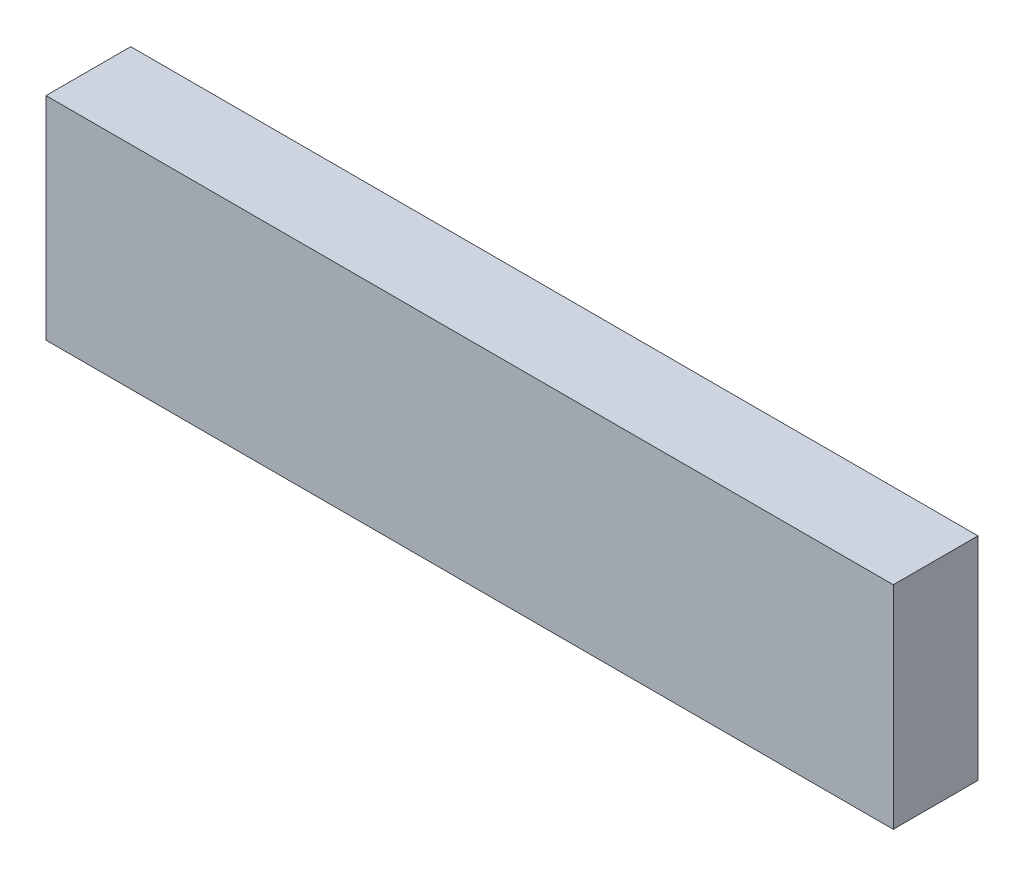
ISO-10303-21;
HEADER;
FILE_DESCRIPTION(('STEP AP214'),'2;1');
FILE_NAME('part.step','',(''),(''),'','','');
FILE_SCHEMA(('AUTOMOTIVE_DESIGN { 1 0 10303 214 1 1 1 1 }'));
ENDSEC;
DATA;
#1=APPLICATION_CONTEXT('core data for automotive mechanical design processes');
#2=APPLICATION_PROTOCOL_DEFINITION('international standard','automotive_design',2000,#1);
#3=PRODUCT_CONTEXT('',#1,'mechanical');
#4=PRODUCT('Part','Part','',(#3));
#5=PRODUCT_RELATED_PRODUCT_CATEGORY('part','',(#4));
#6=PRODUCT_DEFINITION_FORMATION('','',#4);
#7=PRODUCT_DEFINITION_CONTEXT('part definition',#1,'design');
#8=PRODUCT_DEFINITION('design','',#6,#7);
#9=PRODUCT_DEFINITION_SHAPE('','',#8);
#10=(LENGTH_UNIT() NAMED_UNIT(*) SI_UNIT(.MILLI.,.METRE.));
#11=(NAMED_UNIT(*) PLANE_ANGLE_UNIT() SI_UNIT($,.RADIAN.));
#12=(NAMED_UNIT(*) SI_UNIT($,.STERADIAN.) SOLID_ANGLE_UNIT());
#13=UNCERTAINTY_MEASURE_WITH_UNIT(LENGTH_MEASURE(1.E-05),#10,'distance_accuracy_value','');
#14=(GEOMETRIC_REPRESENTATION_CONTEXT(3) GLOBAL_UNCERTAINTY_ASSIGNED_CONTEXT((#13)) GLOBAL_UNIT_ASSIGNED_CONTEXT((#10,
#11,#12)) REPRESENTATION_CONTEXT('',''));
#15=CARTESIAN_POINT('',(0.,0.,0.));
#16=DIRECTION('',(0.,0.,1.));
#17=DIRECTION('',(1.,0.,0.));
#18=AXIS2_PLACEMENT_3D('',#15,#16,#17);
#19=CARTESIAN_POINT('',(198.,-50.01,55.8));
#20=DIRECTION('',(0.,0.,-1.));
#21=DIRECTION('',(-1.,0.,0.));
#22=AXIS2_PLACEMENT_3D('',#19,#20,#21);
#23=PLANE('',#22);
#24=DIRECTION('',(0.,1.,0.));
#25=VECTOR('',#24,1.);
#26=CARTESIAN_POINT('',(198.,-50.01,55.8));
#27=LINE('',#26,#25);
#28=CARTESIAN_POINT('',(198.,-50.,55.8));
#29=VERTEX_POINT('',#28);
#30=CARTESIAN_POINT('',(198.,-47.,55.8));
#31=VERTEX_POINT('',#30);
#32=EDGE_CURVE('E44',#29,#31,#27,.T.);
#33=ORIENTED_EDGE('',*,*,#32,.T.);
#34=DIRECTION('',(1.,0.,0.));
#35=VECTOR('',#34,1.);
#36=CARTESIAN_POINT('',(-300.,-47.,55.8));
#37=LINE('',#36,#35);
#38=CARTESIAN_POINT('',(210.,-47.,55.8));
#39=VERTEX_POINT('',#38);
#40=EDGE_CURVE('E94',#31,#39,#37,.T.);
#41=ORIENTED_EDGE('',*,*,#40,.T.);
#42=DIRECTION('',(0.,1.,0.));
#43=VECTOR('',#42,1.);
#44=CARTESIAN_POINT('',(210.,-50.01,55.8));
#45=LINE('',#44,#43);
#46=CARTESIAN_POINT('',(210.,-50.,55.8));
#47=VERTEX_POINT('',#46);
#48=EDGE_CURVE('E11',#47,#39,#45,.T.);
#49=ORIENTED_EDGE('',*,*,#48,.F.);
#50=DIRECTION('',(-1.,0.,0.));
#51=VECTOR('',#50,1.);
#52=CARTESIAN_POINT('',(-300.,-50.,55.8));
#53=LINE('',#52,#51);
#54=EDGE_CURVE('E39',#47,#29,#53,.T.);
#55=ORIENTED_EDGE('',*,*,#54,.T.);
#56=EDGE_LOOP('',(#33,#41,#49,#55));
#57=FACE_BOUND('',#56,.T.);
#58=ADVANCED_FACE('F35',(#57),#23,.T.);
#59=CARTESIAN_POINT('',(198.,-50.01,55.8));
#60=DIRECTION('',(-1.,0.,0.));
#61=DIRECTION('',(0.,0.,1.));
#62=AXIS2_PLACEMENT_3D('',#59,#60,#61);
#63=PLANE('',#62);
#64=DIRECTION('',(0.,1.,0.));
#65=VECTOR('',#64,1.);
#66=CARTESIAN_POINT('',(198.,-50.01,57.));
#67=LINE('',#66,#65);
#68=CARTESIAN_POINT('',(198.,-50.,57.));
#69=VERTEX_POINT('',#68);
#70=CARTESIAN_POINT('',(198.,-47.,57.));
#71=VERTEX_POINT('',#70);
#72=EDGE_CURVE('E73',#69,#71,#67,.T.);
#73=ORIENTED_EDGE('',*,*,#72,.T.);
#74=DIRECTION('',(0.,0.,-1.));
#75=VECTOR('',#74,1.);
#76=CARTESIAN_POINT('',(198.,-47.,3.));
#77=LINE('',#76,#75);
#78=EDGE_CURVE('E77',#71,#31,#77,.T.);
#79=ORIENTED_EDGE('',*,*,#78,.T.);
#80=ORIENTED_EDGE('',*,*,#32,.F.);
#81=DIRECTION('',(0.,0.,1.));
#82=VECTOR('',#81,1.);
#83=CARTESIAN_POINT('',(198.,-50.,60.));
#84=LINE('',#83,#82);
#85=EDGE_CURVE('E79',#29,#69,#84,.T.);
#86=ORIENTED_EDGE('',*,*,#85,.T.);
#87=EDGE_LOOP('',(#73,#79,#80,#86));
#88=FACE_BOUND('',#87,.T.);
#89=ADVANCED_FACE('F75',(#88),#63,.T.);
#90=CARTESIAN_POINT('',(210.,-50.01,55.8));
#91=DIRECTION('',(1.,0.,0.));
#92=DIRECTION('',(0.,0.,-1.));
#93=AXIS2_PLACEMENT_3D('',#90,#91,#92);
#94=PLANE('',#93);
#95=ORIENTED_EDGE('',*,*,#48,.T.);
#96=DIRECTION('',(0.,0.,1.));
#97=VECTOR('',#96,1.);
#98=CARTESIAN_POINT('',(210.,-47.,3.));
#99=LINE('',#98,#97);
#100=CARTESIAN_POINT('',(210.,-47.,57.));
#101=VERTEX_POINT('',#100);
#102=EDGE_CURVE('E91',#39,#101,#99,.T.);
#103=ORIENTED_EDGE('',*,*,#102,.T.);
#104=DIRECTION('',(0.,1.,0.));
#105=VECTOR('',#104,1.);
#106=CARTESIAN_POINT('',(210.,-50.01,57.));
#107=LINE('',#106,#105);
#108=CARTESIAN_POINT('',(210.,-50.,57.));
#109=VERTEX_POINT('',#108);
#110=EDGE_CURVE('E83',#109,#101,#107,.T.);
#111=ORIENTED_EDGE('',*,*,#110,.F.);
#112=DIRECTION('',(0.,0.,-1.));
#113=VECTOR('',#112,1.);
#114=CARTESIAN_POINT('',(210.,-50.,60.));
#115=LINE('',#114,#113);
#116=EDGE_CURVE('E102',#109,#47,#115,.T.);
#117=ORIENTED_EDGE('',*,*,#116,.T.);
#118=EDGE_LOOP('',(#95,#103,#111,#117));
#119=FACE_BOUND('',#118,.T.);
#120=ADVANCED_FACE('F113',(#119),#94,.T.);
#121=CARTESIAN_POINT('',(198.,-50.01,57.));
#122=DIRECTION('',(0.,0.,1.));
#123=DIRECTION('',(1.,0.,0.));
#124=AXIS2_PLACEMENT_3D('',#121,#122,#123);
#125=PLANE('',#124);
#126=ORIENTED_EDGE('',*,*,#110,.T.);
#127=DIRECTION('',(-1.,0.,0.));
#128=VECTOR('',#127,1.);
#129=CARTESIAN_POINT('',(-300.,-47.,57.));
#130=LINE('',#129,#128);
#131=EDGE_CURVE('E86',#101,#71,#130,.T.);
#132=ORIENTED_EDGE('',*,*,#131,.T.);
#133=ORIENTED_EDGE('',*,*,#72,.F.);
#134=DIRECTION('',(1.,0.,0.));
#135=VECTOR('',#134,1.);
#136=CARTESIAN_POINT('',(-300.,-50.,57.));
#137=LINE('',#136,#135);
#138=EDGE_CURVE('E101',#69,#109,#137,.T.);
#139=ORIENTED_EDGE('',*,*,#138,.T.);
#140=EDGE_LOOP('',(#126,#132,#133,#139));
#141=FACE_BOUND('',#140,.T.);
#142=ADVANCED_FACE('F87',(#141),#125,.T.);
#143=CARTESIAN_POINT('',(-300.,-50.,60.));
#144=DIRECTION('',(0.,1.,0.));
#145=DIRECTION('',(0.,0.,1.));
#146=AXIS2_PLACEMENT_3D('',#143,#144,#145);
#147=PLANE('',#146);
#148=ORIENTED_EDGE('',*,*,#85,.F.);
#149=ORIENTED_EDGE('',*,*,#54,.F.);
#150=ORIENTED_EDGE('',*,*,#116,.F.);
#151=ORIENTED_EDGE('',*,*,#138,.F.);
#152=EDGE_LOOP('',(#148,#149,#150,#151));
#153=FACE_BOUND('',#152,.T.);
#154=ADVANCED_FACE('F107',(#153),#147,.F.);
#155=CARTESIAN_POINT('',(-300.,-47.,3.));
#156=DIRECTION('',(0.,-1.,0.));
#157=DIRECTION('',(0.,0.,-1.));
#158=AXIS2_PLACEMENT_3D('',#155,#156,#157);
#159=PLANE('',#158);
#160=ORIENTED_EDGE('',*,*,#78,.F.);
#161=ORIENTED_EDGE('',*,*,#131,.F.);
#162=ORIENTED_EDGE('',*,*,#102,.F.);
#163=ORIENTED_EDGE('',*,*,#40,.F.);
#164=EDGE_LOOP('',(#160,#161,#162,#163));
#165=FACE_BOUND('',#164,.T.);
#166=ADVANCED_FACE('F37',(#165),#159,.F.);
#167=CLOSED_SHELL('',(#58,#89,#120,#142,#154,#166));
#168=MANIFOLD_SOLID_BREP('B2',#167);
#169=ADVANCED_BREP_SHAPE_REPRESENTATION('',(#18,#168),#14);
#170=SHAPE_DEFINITION_REPRESENTATION(#9,#169);
ENDSEC;
END-ISO-10303-21;
